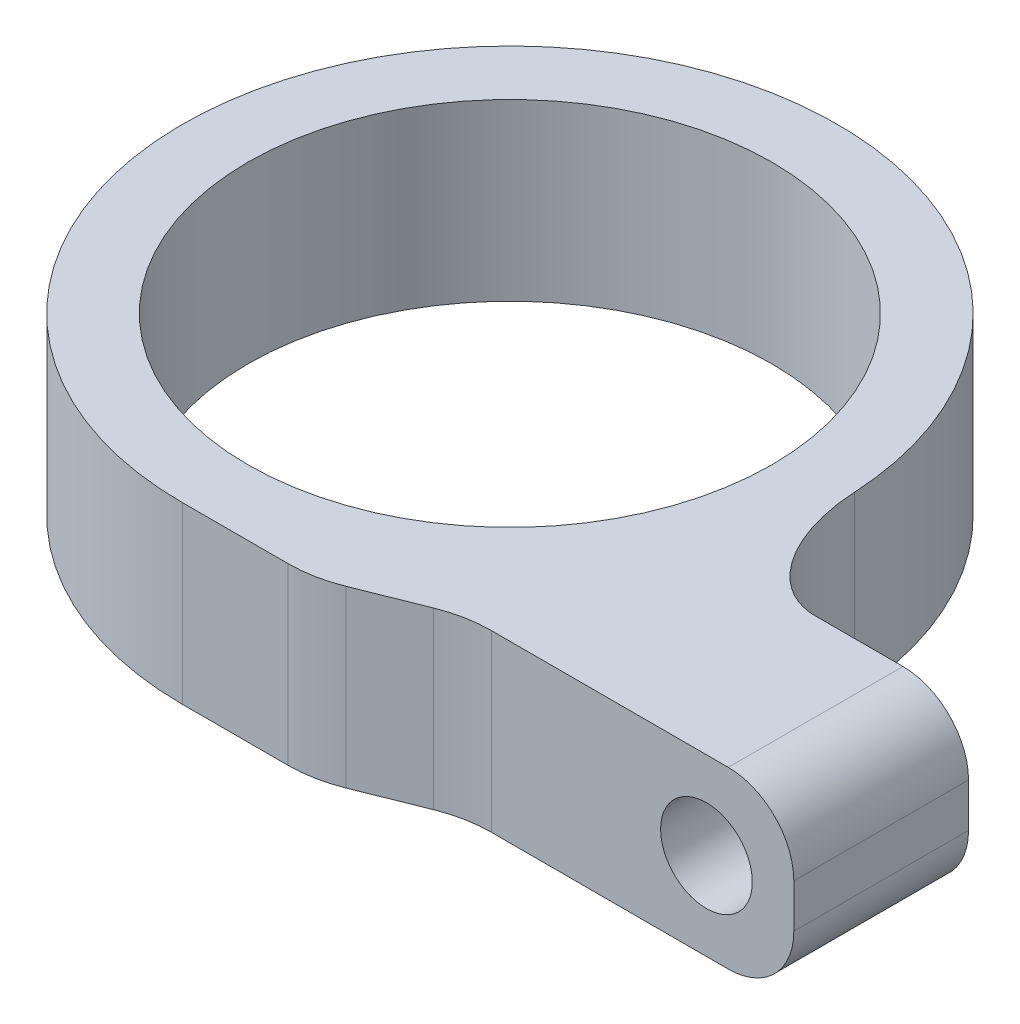
ISO-10303-21;
HEADER;
FILE_DESCRIPTION(('STEP AP214'),'2;1');
FILE_NAME('part.step','',(''),(''),'','','');
FILE_SCHEMA(('AUTOMOTIVE_DESIGN { 1 0 10303 214 1 1 1 1 }'));
ENDSEC;
DATA;
#1=APPLICATION_CONTEXT('core data for automotive mechanical design processes');
#2=APPLICATION_PROTOCOL_DEFINITION('international standard','automotive_design',2000,#1);
#3=PRODUCT_CONTEXT('',#1,'mechanical');
#4=PRODUCT('Part','Part','',(#3));
#5=PRODUCT_RELATED_PRODUCT_CATEGORY('part','',(#4));
#6=PRODUCT_DEFINITION_FORMATION('','',#4);
#7=PRODUCT_DEFINITION_CONTEXT('part definition',#1,'design');
#8=PRODUCT_DEFINITION('design','',#6,#7);
#9=PRODUCT_DEFINITION_SHAPE('','',#8);
#10=(LENGTH_UNIT() NAMED_UNIT(*) SI_UNIT(.MILLI.,.METRE.));
#11=(NAMED_UNIT(*) PLANE_ANGLE_UNIT() SI_UNIT($,.RADIAN.));
#12=(NAMED_UNIT(*) SI_UNIT($,.STERADIAN.) SOLID_ANGLE_UNIT());
#13=UNCERTAINTY_MEASURE_WITH_UNIT(LENGTH_MEASURE(1.E-05),#10,'distance_accuracy_value','');
#14=(GEOMETRIC_REPRESENTATION_CONTEXT(3) GLOBAL_UNCERTAINTY_ASSIGNED_CONTEXT((#13)) GLOBAL_UNIT_ASSIGNED_CONTEXT((#10,
#11,#12)) REPRESENTATION_CONTEXT('',''));
#15=CARTESIAN_POINT('',(0.,0.,0.));
#16=DIRECTION('',(0.,0.,1.));
#17=DIRECTION('',(1.,0.,0.));
#18=AXIS2_PLACEMENT_3D('',#15,#16,#17);
#19=CARTESIAN_POINT('',(0.,8.,0.));
#20=DIRECTION('',(0.,1.,0.));
#21=DIRECTION('',(0.,0.,1.));
#22=AXIS2_PLACEMENT_3D('',#19,#20,#21);
#23=PLANE('',#22);
#24=DIRECTION('',(1.,0.,0.));
#25=VECTOR('',#24,1.);
#26=CARTESIAN_POINT('',(11.,8.,13.));
#27=LINE('',#26,#25);
#28=CARTESIAN_POINT('',(12.1554944214035,8.,13.));
#29=VERTEX_POINT('',#28);
#30=CARTESIAN_POINT('',(23.,8.,13.));
#31=VERTEX_POINT('',#30);
#32=EDGE_CURVE('E202',#29,#31,#27,.T.);
#33=ORIENTED_EDGE('',*,*,#32,.T.);
#34=DIRECTION('',(0.,0.,-1.));
#35=VECTOR('',#34,1.);
#36=CARTESIAN_POINT('',(23.,8.,5.));
#37=LINE('',#36,#35);
#38=CARTESIAN_POINT('',(23.,8.,5.));
#39=VERTEX_POINT('',#38);
#40=EDGE_CURVE('E12',#31,#39,#37,.T.);
#41=ORIENTED_EDGE('',*,*,#40,.T.);
#42=DIRECTION('',(-1.,0.,0.));
#43=VECTOR('',#42,1.);
#44=CARTESIAN_POINT('',(26.,8.,5.));
#45=LINE('',#44,#43);
#46=CARTESIAN_POINT('',(18.9736659610103,8.,5.));
#47=VERTEX_POINT('',#46);
#48=EDGE_CURVE('E200',#39,#47,#45,.T.);
#49=ORIENTED_EDGE('',*,*,#48,.T.);
#50=CARTESIAN_POINT('',(14.9792099692186,8.,-0.789473684210525));
#51=CARTESIAN_POINT('',(15.2843420241472,8.,5.));
#52=CARTESIAN_POINT('',(18.9736659610103,8.,5.));
#53=(BOUNDED_CURVE() B_SPLINE_CURVE(2,(#50,#51,#52),.UNSPECIFIED.,.F.,
.F.) B_SPLINE_CURVE_WITH_KNOTS((3,3),(0.,1.),
.UNSPECIFIED.) CURVE() GEOMETRIC_REPRESENTATION_ITEM() RATIONAL_B_SPLINE_CURVE((1.,
0.725476250110012,1.)) REPRESENTATION_ITEM(''));
#54=CARTESIAN_POINT('',(14.9792099692186,8.,-0.789473684210525));
#55=VERTEX_POINT('',#54);
#56=EDGE_CURVE('E132',#47,#55,#53,.F.);
#57=ORIENTED_EDGE('',*,*,#56,.T.);
#58=CARTESIAN_POINT('',(0.,8.,0.));
#59=DIRECTION('',(0.,1.,0.));
#60=DIRECTION('',(0.,0.,1.));
#61=AXIS2_PLACEMENT_3D('',#58,#59,#60);
#62=CIRCLE('',#61,15.);
#63=CARTESIAN_POINT('',(0.,8.,15.));
#64=VERTEX_POINT('',#63);
#65=EDGE_CURVE('E126',#55,#64,#62,.T.);
#66=ORIENTED_EDGE('',*,*,#65,.T.);
#67=DIRECTION('',(1.,0.,0.));
#68=VECTOR('',#67,1.);
#69=CARTESIAN_POINT('',(0.,8.,15.));
#70=LINE('',#69,#68);
#71=CARTESIAN_POINT('',(4.84450557859649,8.,15.));
#72=VERTEX_POINT('',#71);
#73=EDGE_CURVE('E129',#64,#72,#70,.T.);
#74=ORIENTED_EDGE('',*,*,#73,.T.);
#75=CARTESIAN_POINT('',(4.84450557859649,8.,9.));
#76=DIRECTION('',(0.,1.,0.));
#77=DIRECTION('',(0.,0.,1.));
#78=AXIS2_PLACEMENT_3D('',#75,#76,#77);
#79=CIRCLE('',#78,6.);
#80=CARTESIAN_POINT('',(7.07284963672111,8.,14.5708601453116));
#81=VERTEX_POINT('',#80);
#82=EDGE_CURVE('E171',#72,#81,#79,.T.);
#83=ORIENTED_EDGE('',*,*,#82,.T.);
#84=DIRECTION('',(0.928476690885259,0.,-0.371390676354104));
#85=VECTOR('',#84,1.);
#86=CARTESIAN_POINT('',(6.,8.,15.));
#87=LINE('',#86,#85);
#88=CARTESIAN_POINT('',(9.92715036327889,8.,13.4291398546884));
#89=VERTEX_POINT('',#88);
#90=EDGE_CURVE('E147',#81,#89,#87,.T.);
#91=ORIENTED_EDGE('',*,*,#90,.T.);
#92=CARTESIAN_POINT('',(12.1554944214035,8.,19.));
#93=DIRECTION('',(0.,1.,0.));
#94=DIRECTION('',(0.,0.,1.));
#95=AXIS2_PLACEMENT_3D('',#92,#93,#94);
#96=CIRCLE('',#95,6.);
#97=EDGE_CURVE('E175',#89,#29,#96,.F.);
#98=ORIENTED_EDGE('',*,*,#97,.T.);
#99=EDGE_LOOP('',(#33,#41,#49,#57,#66,#74,#83,#91,#98));
#100=FACE_BOUND('',#99,.T.);
#101=CARTESIAN_POINT('',(0.,8.,0.));
#102=DIRECTION('',(0.,1.,0.));
#103=DIRECTION('',(0.,0.,1.));
#104=AXIS2_PLACEMENT_3D('',#101,#102,#103);
#105=CIRCLE('',#104,12.);
#106=CARTESIAN_POINT('',(0.,8.,12.));
#107=VERTEX_POINT('',#106);
#108=EDGE_CURVE('E180',#107,#107,#105,.T.);
#109=ORIENTED_EDGE('',*,*,#108,.F.);
#110=EDGE_LOOP('',(#109));
#111=FACE_BOUND('',#110,.T.);
#112=ADVANCED_FACE('F39',(#100,#111),#23,.T.);
#113=CARTESIAN_POINT('',(0.,0.,0.));
#114=DIRECTION('',(0.,1.,0.));
#115=DIRECTION('',(0.,0.,1.));
#116=AXIS2_PLACEMENT_3D('',#113,#114,#115);
#117=PLANE('',#116);
#118=DIRECTION('',(-1.,0.,0.));
#119=VECTOR('',#118,1.);
#120=CARTESIAN_POINT('',(26.,0.,5.));
#121=LINE('',#120,#119);
#122=CARTESIAN_POINT('',(23.,0.,5.));
#123=VERTEX_POINT('',#122);
#124=CARTESIAN_POINT('',(18.9736659610103,0.,5.));
#125=VERTEX_POINT('',#124);
#126=EDGE_CURVE('E138',#123,#125,#121,.T.);
#127=ORIENTED_EDGE('',*,*,#126,.F.);
#128=DIRECTION('',(0.,0.,-1.));
#129=VECTOR('',#128,1.);
#130=CARTESIAN_POINT('',(23.,0.,0.));
#131=LINE('',#130,#129);
#132=CARTESIAN_POINT('',(23.,0.,13.));
#133=VERTEX_POINT('',#132);
#134=EDGE_CURVE('E62',#123,#133,#131,.F.);
#135=ORIENTED_EDGE('',*,*,#134,.T.);
#136=DIRECTION('',(1.,0.,0.));
#137=VECTOR('',#136,1.);
#138=CARTESIAN_POINT('',(11.,0.,13.));
#139=LINE('',#138,#137);
#140=CARTESIAN_POINT('',(12.1554944214035,0.,13.));
#141=VERTEX_POINT('',#140);
#142=EDGE_CURVE('E192',#141,#133,#139,.T.);
#143=ORIENTED_EDGE('',*,*,#142,.F.);
#144=CARTESIAN_POINT('',(12.1554944214035,0.,19.));
#145=DIRECTION('',(0.,1.,0.));
#146=DIRECTION('',(0.,0.,1.));
#147=AXIS2_PLACEMENT_3D('',#144,#145,#146);
#148=CIRCLE('',#147,6.);
#149=CARTESIAN_POINT('',(9.92715036327889,0.,13.4291398546884));
#150=VERTEX_POINT('',#149);
#151=EDGE_CURVE('E173',#141,#150,#148,.T.);
#152=ORIENTED_EDGE('',*,*,#151,.T.);
#153=DIRECTION('',(0.928476690885259,0.,-0.371390676354104));
#154=VECTOR('',#153,1.);
#155=CARTESIAN_POINT('',(6.,0.,15.));
#156=LINE('',#155,#154);
#157=CARTESIAN_POINT('',(7.07284963672111,0.,14.5708601453116));
#158=VERTEX_POINT('',#157);
#159=EDGE_CURVE('E189',#158,#150,#156,.T.);
#160=ORIENTED_EDGE('',*,*,#159,.F.);
#161=CARTESIAN_POINT('',(4.84450557859649,0.,9.));
#162=DIRECTION('',(0.,1.,0.));
#163=DIRECTION('',(0.,0.,1.));
#164=AXIS2_PLACEMENT_3D('',#161,#162,#163);
#165=CIRCLE('',#164,6.);
#166=CARTESIAN_POINT('',(4.84450557859649,0.,15.));
#167=VERTEX_POINT('',#166);
#168=EDGE_CURVE('E168',#158,#167,#165,.F.);
#169=ORIENTED_EDGE('',*,*,#168,.T.);
#170=DIRECTION('',(1.,0.,0.));
#171=VECTOR('',#170,1.);
#172=CARTESIAN_POINT('',(0.,0.,15.));
#173=LINE('',#172,#171);
#174=CARTESIAN_POINT('',(0.,0.,15.));
#175=VERTEX_POINT('',#174);
#176=EDGE_CURVE('E179',#175,#167,#173,.T.);
#177=ORIENTED_EDGE('',*,*,#176,.F.);
#178=CARTESIAN_POINT('',(0.,0.,0.));
#179=DIRECTION('',(0.,1.,0.));
#180=DIRECTION('',(0.,0.,1.));
#181=AXIS2_PLACEMENT_3D('',#178,#179,#180);
#182=CIRCLE('',#181,15.);
#183=CARTESIAN_POINT('',(14.9792099692186,0.,-0.789473684210525));
#184=VERTEX_POINT('',#183);
#185=EDGE_CURVE('E151',#184,#175,#182,.T.);
#186=ORIENTED_EDGE('',*,*,#185,.F.);
#187=CARTESIAN_POINT('',(18.9736659610103,0.,5.));
#188=CARTESIAN_POINT('',(15.2843420241472,0.,5.));
#189=CARTESIAN_POINT('',(14.9792099692186,0.,-0.789473684210524));
#190=(BOUNDED_CURVE() B_SPLINE_CURVE(2,(#187,#188,#189),.UNSPECIFIED.,.F.,
.F.) B_SPLINE_CURVE_WITH_KNOTS((3,3),(0.,1.),
.UNSPECIFIED.) CURVE() GEOMETRIC_REPRESENTATION_ITEM() RATIONAL_B_SPLINE_CURVE((1.,
0.725476250110012,1.)) REPRESENTATION_ITEM(''));
#191=EDGE_CURVE('E220',#184,#125,#190,.F.);
#192=ORIENTED_EDGE('',*,*,#191,.T.);
#193=EDGE_LOOP('',(#127,#135,#143,#152,#160,#169,#177,#186,#192));
#194=FACE_BOUND('',#193,.T.);
#195=CARTESIAN_POINT('',(0.,0.,0.));
#196=DIRECTION('',(0.,1.,0.));
#197=DIRECTION('',(0.,0.,1.));
#198=AXIS2_PLACEMENT_3D('',#195,#196,#197);
#199=CIRCLE('',#198,12.);
#200=CARTESIAN_POINT('',(0.,0.,12.));
#201=VERTEX_POINT('',#200);
#202=EDGE_CURVE('E437',#201,#201,#199,.T.);
#203=ORIENTED_EDGE('',*,*,#202,.T.);
#204=EDGE_LOOP('',(#203));
#205=FACE_BOUND('',#204,.T.);
#206=ADVANCED_FACE('F292',(#194,#205),#117,.F.);
#207=CARTESIAN_POINT('',(0.,8.,0.));
#208=DIRECTION('',(0.,-1.,0.));
#209=DIRECTION('',(0.,0.,-1.));
#210=AXIS2_PLACEMENT_3D('',#207,#208,#209);
#211=CYLINDRICAL_SURFACE('',#210,15.);
#212=ORIENTED_EDGE('',*,*,#65,.F.);
#213=CARTESIAN_POINT('',(14.9792099692186,-0.399999999999999,-0.789473684210525));
#214=CARTESIAN_POINT('',(14.9792099692186,2.53333333333334,-0.789473684210525));
#215=CARTESIAN_POINT('',(14.9792099692186,5.46666666666667,-0.789473684210525));
#216=CARTESIAN_POINT('',(14.9792099692186,8.4,-0.789473684210525));
#217=(BOUNDED_CURVE() B_SPLINE_CURVE(3,(#213,#214,#215,#216),.UNSPECIFIED.,.F.,
.F.) B_SPLINE_CURVE_WITH_KNOTS((4,4),(-0.0084,0.0004),
.UNSPECIFIED.) CURVE() GEOMETRIC_REPRESENTATION_ITEM() RATIONAL_B_SPLINE_CURVE((1.,1.,1.,1.)) REPRESENTATION_ITEM(''));
#218=EDGE_CURVE('E177',#55,#184,#217,.F.);
#219=ORIENTED_EDGE('',*,*,#218,.T.);
#220=ORIENTED_EDGE('',*,*,#185,.T.);
#221=DIRECTION('',(0.,-1.,0.));
#222=VECTOR('',#221,1.);
#223=CARTESIAN_POINT('',(0.,8.,15.));
#224=LINE('',#223,#222);
#225=EDGE_CURVE('E144',#64,#175,#224,.T.);
#226=ORIENTED_EDGE('',*,*,#225,.F.);
#227=EDGE_LOOP('',(#212,#219,#220,#226));
#228=FACE_BOUND('',#227,.T.);
#229=ADVANCED_FACE('F149',(#228),#211,.T.);
#230=CARTESIAN_POINT('',(0.,8.,15.));
#231=DIRECTION('',(0.,0.,-1.));
#232=DIRECTION('',(-1.,0.,0.));
#233=AXIS2_PLACEMENT_3D('',#230,#231,#232);
#234=PLANE('',#233);
#235=ORIENTED_EDGE('',*,*,#176,.T.);
#236=DIRECTION('',(0.,-1.,0.));
#237=VECTOR('',#236,1.);
#238=CARTESIAN_POINT('',(4.84450557859649,8.,15.));
#239=LINE('',#238,#237);
#240=EDGE_CURVE('E146',#167,#72,#239,.F.);
#241=ORIENTED_EDGE('',*,*,#240,.T.);
#242=ORIENTED_EDGE('',*,*,#73,.F.);
#243=ORIENTED_EDGE('',*,*,#225,.T.);
#244=EDGE_LOOP('',(#235,#241,#242,#243));
#245=FACE_BOUND('',#244,.T.);
#246=ADVANCED_FACE('F143',(#245),#234,.F.);
#247=CARTESIAN_POINT('',(6.,8.,15.));
#248=DIRECTION('',(-0.371390676354104,0.,-0.928476690885259));
#249=DIRECTION('',(-0.928476690885259,0.,0.371390676354104));
#250=AXIS2_PLACEMENT_3D('',#247,#248,#249);
#251=PLANE('',#250);
#252=ORIENTED_EDGE('',*,*,#159,.T.);
#253=DIRECTION('',(0.,-1.,0.));
#254=VECTOR('',#253,1.);
#255=CARTESIAN_POINT('',(9.92715036327889,8.,13.4291398546884));
#256=LINE('',#255,#254);
#257=EDGE_CURVE('E166',#150,#89,#256,.F.);
#258=ORIENTED_EDGE('',*,*,#257,.T.);
#259=ORIENTED_EDGE('',*,*,#90,.F.);
#260=DIRECTION('',(0.,-1.,0.));
#261=VECTOR('',#260,1.);
#262=CARTESIAN_POINT('',(7.07284963672111,8.,14.5708601453116));
#263=LINE('',#262,#261);
#264=EDGE_CURVE('E157',#81,#158,#263,.T.);
#265=ORIENTED_EDGE('',*,*,#264,.T.);
#266=EDGE_LOOP('',(#252,#258,#259,#265));
#267=FACE_BOUND('',#266,.T.);
#268=ADVANCED_FACE('F323',(#267),#251,.F.);
#269=CARTESIAN_POINT('',(11.,8.,13.));
#270=DIRECTION('',(0.,0.,-1.));
#271=DIRECTION('',(-1.,0.,0.));
#272=AXIS2_PLACEMENT_3D('',#269,#270,#271);
#273=PLANE('',#272);
#274=CARTESIAN_POINT('',(22.,4.,13.));
#275=DIRECTION('',(0.,0.,-1.));
#276=DIRECTION('',(-1.,0.,0.));
#277=AXIS2_PLACEMENT_3D('',#274,#275,#276);
#278=CIRCLE('',#277,2.1);
#279=CARTESIAN_POINT('',(19.9,4.,13.));
#280=VERTEX_POINT('',#279);
#281=EDGE_CURVE('E440',#280,#280,#278,.T.);
#282=ORIENTED_EDGE('',*,*,#281,.T.);
#283=EDGE_LOOP('',(#282));
#284=FACE_BOUND('',#283,.T.);
#285=ORIENTED_EDGE('',*,*,#142,.T.);
#286=CARTESIAN_POINT('',(23.,3.,13.));
#287=DIRECTION('',(0.,0.,-1.));
#288=DIRECTION('',(-1.,0.,0.));
#289=AXIS2_PLACEMENT_3D('',#286,#287,#288);
#290=CIRCLE('',#289,3.);
#291=CARTESIAN_POINT('',(26.,3.,13.));
#292=VERTEX_POINT('',#291);
#293=EDGE_CURVE('E47',#133,#292,#290,.F.);
#294=ORIENTED_EDGE('',*,*,#293,.T.);
#295=DIRECTION('',(0.,-1.,0.));
#296=VECTOR('',#295,1.);
#297=CARTESIAN_POINT('',(26.,8.,13.));
#298=LINE('',#297,#296);
#299=CARTESIAN_POINT('',(26.,5.,13.));
#300=VERTEX_POINT('',#299);
#301=EDGE_CURVE('E154',#300,#292,#298,.T.);
#302=ORIENTED_EDGE('',*,*,#301,.F.);
#303=CARTESIAN_POINT('',(23.,5.,13.));
#304=DIRECTION('',(0.,0.,-1.));
#305=DIRECTION('',(-1.,0.,0.));
#306=AXIS2_PLACEMENT_3D('',#303,#304,#305);
#307=CIRCLE('',#306,3.);
#308=EDGE_CURVE('E54',#300,#31,#307,.F.);
#309=ORIENTED_EDGE('',*,*,#308,.T.);
#310=ORIENTED_EDGE('',*,*,#32,.F.);
#311=DIRECTION('',(0.,-1.,0.));
#312=VECTOR('',#311,1.);
#313=CARTESIAN_POINT('',(12.1554944214035,0.,13.));
#314=LINE('',#313,#312);
#315=EDGE_CURVE('E153',#29,#141,#314,.T.);
#316=ORIENTED_EDGE('',*,*,#315,.T.);
#317=EDGE_LOOP('',(#285,#294,#302,#309,#310,#316));
#318=FACE_BOUND('',#317,.T.);
#319=ADVANCED_FACE('F209',(#284,#318),#273,.F.);
#320=CARTESIAN_POINT('',(26.,8.,13.));
#321=DIRECTION('',(-1.,0.,0.));
#322=DIRECTION('',(0.,0.,1.));
#323=AXIS2_PLACEMENT_3D('',#320,#321,#322);
#324=PLANE('',#323);
#325=ORIENTED_EDGE('',*,*,#301,.T.);
#326=DIRECTION('',(0.,0.,-1.));
#327=VECTOR('',#326,1.);
#328=CARTESIAN_POINT('',(26.,3.,13.));
#329=LINE('',#328,#327);
#330=CARTESIAN_POINT('',(26.,3.,5.));
#331=VERTEX_POINT('',#330);
#332=EDGE_CURVE('E198',#292,#331,#329,.T.);
#333=ORIENTED_EDGE('',*,*,#332,.T.);
#334=DIRECTION('',(0.,-1.,0.));
#335=VECTOR('',#334,1.);
#336=CARTESIAN_POINT('',(26.,8.,5.));
#337=LINE('',#336,#335);
#338=CARTESIAN_POINT('',(26.,5.,5.));
#339=VERTEX_POINT('',#338);
#340=EDGE_CURVE('E160',#339,#331,#337,.T.);
#341=ORIENTED_EDGE('',*,*,#340,.F.);
#342=DIRECTION('',(0.,0.,-1.));
#343=VECTOR('',#342,1.);
#344=CARTESIAN_POINT('',(26.,5.,13.));
#345=LINE('',#344,#343);
#346=EDGE_CURVE('E218',#339,#300,#345,.F.);
#347=ORIENTED_EDGE('',*,*,#346,.T.);
#348=EDGE_LOOP('',(#325,#333,#341,#347));
#349=FACE_BOUND('',#348,.T.);
#350=ADVANCED_FACE('F214',(#349),#324,.F.);
#351=CARTESIAN_POINT('',(26.,8.,5.));
#352=DIRECTION('',(0.,0.,1.));
#353=DIRECTION('',(1.,0.,0.));
#354=AXIS2_PLACEMENT_3D('',#351,#352,#353);
#355=PLANE('',#354);
#356=CARTESIAN_POINT('',(22.,4.,5.));
#357=DIRECTION('',(0.,0.,-1.));
#358=DIRECTION('',(-1.,0.,0.));
#359=AXIS2_PLACEMENT_3D('',#356,#357,#358);
#360=CIRCLE('',#359,2.1);
#361=CARTESIAN_POINT('',(19.9,4.,5.));
#362=VERTEX_POINT('',#361);
#363=EDGE_CURVE('E445',#362,#362,#360,.T.);
#364=ORIENTED_EDGE('',*,*,#363,.F.);
#365=EDGE_LOOP('',(#364));
#366=FACE_BOUND('',#365,.T.);
#367=ORIENTED_EDGE('',*,*,#340,.T.);
#368=CARTESIAN_POINT('',(23.,3.,5.));
#369=DIRECTION('',(0.,0.,1.));
#370=DIRECTION('',(1.,0.,0.));
#371=AXIS2_PLACEMENT_3D('',#368,#369,#370);
#372=CIRCLE('',#371,3.);
#373=EDGE_CURVE('E205',#331,#123,#372,.F.);
#374=ORIENTED_EDGE('',*,*,#373,.T.);
#375=ORIENTED_EDGE('',*,*,#126,.T.);
#376=CARTESIAN_POINT('',(18.9736659610103,8.4,5.));
#377=CARTESIAN_POINT('',(18.9736659610103,5.46666666666667,5.));
#378=CARTESIAN_POINT('',(18.9736659610103,2.53333333333334,5.));
#379=CARTESIAN_POINT('',(18.9736659610103,-0.399999999999999,5.));
#380=(BOUNDED_CURVE() B_SPLINE_CURVE(3,(#376,#377,#378,#379),.UNSPECIFIED.,.F.,
.F.) B_SPLINE_CURVE_WITH_KNOTS((4,4),(-0.0084,0.000399999999999999),
.UNSPECIFIED.) CURVE() GEOMETRIC_REPRESENTATION_ITEM() RATIONAL_B_SPLINE_CURVE((1.,1.,1.,1.)) REPRESENTATION_ITEM(''));
#381=EDGE_CURVE('E286',#125,#47,#380,.F.);
#382=ORIENTED_EDGE('',*,*,#381,.T.);
#383=ORIENTED_EDGE('',*,*,#48,.F.);
#384=CARTESIAN_POINT('',(23.,5.,5.));
#385=DIRECTION('',(0.,0.,1.));
#386=DIRECTION('',(1.,0.,0.));
#387=AXIS2_PLACEMENT_3D('',#384,#385,#386);
#388=CIRCLE('',#387,3.);
#389=EDGE_CURVE('E203',#39,#339,#388,.F.);
#390=ORIENTED_EDGE('',*,*,#389,.T.);
#391=EDGE_LOOP('',(#367,#374,#375,#382,#383,#390));
#392=FACE_BOUND('',#391,.T.);
#393=ADVANCED_FACE('F313',(#366,#392),#355,.F.);
#394=CARTESIAN_POINT('',(0.,8.,0.));
#395=DIRECTION('',(0.,-1.,0.));
#396=DIRECTION('',(0.,0.,-1.));
#397=AXIS2_PLACEMENT_3D('',#394,#395,#396);
#398=CYLINDRICAL_SURFACE('',#397,12.);
#399=ORIENTED_EDGE('',*,*,#108,.T.);
#400=EDGE_LOOP('',(#399));
#401=FACE_BOUND('',#400,.T.);
#402=ORIENTED_EDGE('',*,*,#202,.F.);
#403=EDGE_LOOP('',(#402));
#404=FACE_BOUND('',#403,.T.);
#405=ADVANCED_FACE('F317',(#401,#404),#398,.F.);
#406=CARTESIAN_POINT('',(12.1554944214035,8.,19.));
#407=DIRECTION('',(0.,1.,0.));
#408=DIRECTION('',(0.,0.,1.));
#409=AXIS2_PLACEMENT_3D('',#406,#407,#408);
#410=CYLINDRICAL_SURFACE('',#409,6.);
#411=ORIENTED_EDGE('',*,*,#97,.F.);
#412=ORIENTED_EDGE('',*,*,#257,.F.);
#413=ORIENTED_EDGE('',*,*,#151,.F.);
#414=ORIENTED_EDGE('',*,*,#315,.F.);
#415=EDGE_LOOP('',(#411,#412,#413,#414));
#416=FACE_BOUND('',#415,.T.);
#417=ADVANCED_FACE('F332',(#416),#410,.F.);
#418=CARTESIAN_POINT('',(4.84450557859649,8.,9.));
#419=DIRECTION('',(0.,-1.,0.));
#420=DIRECTION('',(0.,0.,-1.));
#421=AXIS2_PLACEMENT_3D('',#418,#419,#420);
#422=CYLINDRICAL_SURFACE('',#421,6.);
#423=ORIENTED_EDGE('',*,*,#82,.F.);
#424=ORIENTED_EDGE('',*,*,#240,.F.);
#425=ORIENTED_EDGE('',*,*,#168,.F.);
#426=ORIENTED_EDGE('',*,*,#264,.F.);
#427=EDGE_LOOP('',(#423,#424,#425,#426));
#428=FACE_BOUND('',#427,.T.);
#429=ADVANCED_FACE('F243',(#428),#422,.T.);
#430=CARTESIAN_POINT('',(22.,4.,15.));
#431=DIRECTION('',(0.,0.,-1.));
#432=DIRECTION('',(-1.,0.,0.));
#433=AXIS2_PLACEMENT_3D('',#430,#431,#432);
#434=CYLINDRICAL_SURFACE('',#433,2.1);
#435=ORIENTED_EDGE('',*,*,#363,.T.);
#436=EDGE_LOOP('',(#435));
#437=FACE_BOUND('',#436,.T.);
#438=ORIENTED_EDGE('',*,*,#281,.F.);
#439=EDGE_LOOP('',(#438));
#440=FACE_BOUND('',#439,.T.);
#441=ADVANCED_FACE('F241',(#437,#440),#434,.F.);
#442=CARTESIAN_POINT('',(18.9736659610103,-0.399999999999999,5.));
#443=CARTESIAN_POINT('',(18.9736659610103,2.53333333333334,5.));
#444=CARTESIAN_POINT('',(18.9736659610103,5.46666666666667,5.));
#445=CARTESIAN_POINT('',(18.9736659610103,8.4,5.));
#446=CARTESIAN_POINT('',(15.2843420241472,-0.399999999999999,5.));
#447=CARTESIAN_POINT('',(15.2843420241472,2.53333333333334,5.));
#448=CARTESIAN_POINT('',(15.2843420241472,5.46666666666667,5.));
#449=CARTESIAN_POINT('',(15.2843420241472,8.4,5.));
#450=CARTESIAN_POINT('',(14.9792099692186,-0.399999999999999,-0.789473684210525));
#451=CARTESIAN_POINT('',(14.9792099692186,2.53333333333334,-0.789473684210525));
#452=CARTESIAN_POINT('',(14.9792099692186,5.46666666666667,-0.789473684210525));
#453=CARTESIAN_POINT('',(14.9792099692186,8.4,-0.789473684210525));
#454=(BOUNDED_SURFACE() B_SPLINE_SURFACE(2,3,((#442,#443,#444,#445),(#446,#447,#448,#449),(#450,
#451,#452,#453)),.UNSPECIFIED.,.F.,.F.,.F.) B_SPLINE_SURFACE_WITH_KNOTS((3,3),(4,4),(0.,1.),
(-0.0084,0.0004),.UNSPECIFIED.) GEOMETRIC_REPRESENTATION_ITEM() RATIONAL_B_SPLINE_SURFACE(((1.,
1.,1.,1.),(0.725476250110012,0.725476250110012,0.725476250110012,0.725476250110012),(1.,1.,1.,1.))) REPRESENTATION_ITEM('') SURFACE());
#455=ORIENTED_EDGE('',*,*,#56,.F.);
#456=ORIENTED_EDGE('',*,*,#381,.F.);
#457=ORIENTED_EDGE('',*,*,#191,.F.);
#458=ORIENTED_EDGE('',*,*,#218,.F.);
#459=EDGE_LOOP('',(#455,#456,#457,#458));
#460=FACE_BOUND('',#459,.T.);
#461=ADVANCED_FACE('F228',(#460),#454,.T.);
#462=CARTESIAN_POINT('',(23.,3.,13.));
#463=DIRECTION('',(0.,0.,-1.));
#464=DIRECTION('',(-1.,0.,0.));
#465=AXIS2_PLACEMENT_3D('',#462,#463,#464);
#466=CYLINDRICAL_SURFACE('',#465,3.);
#467=ORIENTED_EDGE('',*,*,#293,.F.);
#468=ORIENTED_EDGE('',*,*,#134,.F.);
#469=ORIENTED_EDGE('',*,*,#373,.F.);
#470=ORIENTED_EDGE('',*,*,#332,.F.);
#471=EDGE_LOOP('',(#467,#468,#469,#470));
#472=FACE_BOUND('',#471,.T.);
#473=ADVANCED_FACE('F219',(#472),#466,.T.);
#474=CARTESIAN_POINT('',(23.,5.,0.));
#475=DIRECTION('',(0.,0.,1.));
#476=DIRECTION('',(1.,0.,0.));
#477=AXIS2_PLACEMENT_3D('',#474,#475,#476);
#478=CYLINDRICAL_SURFACE('',#477,3.);
#479=ORIENTED_EDGE('',*,*,#308,.F.);
#480=ORIENTED_EDGE('',*,*,#346,.F.);
#481=ORIENTED_EDGE('',*,*,#389,.F.);
#482=ORIENTED_EDGE('',*,*,#40,.F.);
#483=EDGE_LOOP('',(#479,#480,#481,#482));
#484=FACE_BOUND('',#483,.T.);
#485=ADVANCED_FACE('F41',(#484),#478,.T.);
#486=CLOSED_SHELL('',(#112,#206,#229,#246,#268,#319,#350,#393,#405,#417,#429,#441,#461,#473,#485));
#487=MANIFOLD_SOLID_BREP('B2',#486);
#488=ADVANCED_BREP_SHAPE_REPRESENTATION('',(#18,#487),#14);
#489=SHAPE_DEFINITION_REPRESENTATION(#9,#488);
ENDSEC;
END-ISO-10303-21;
